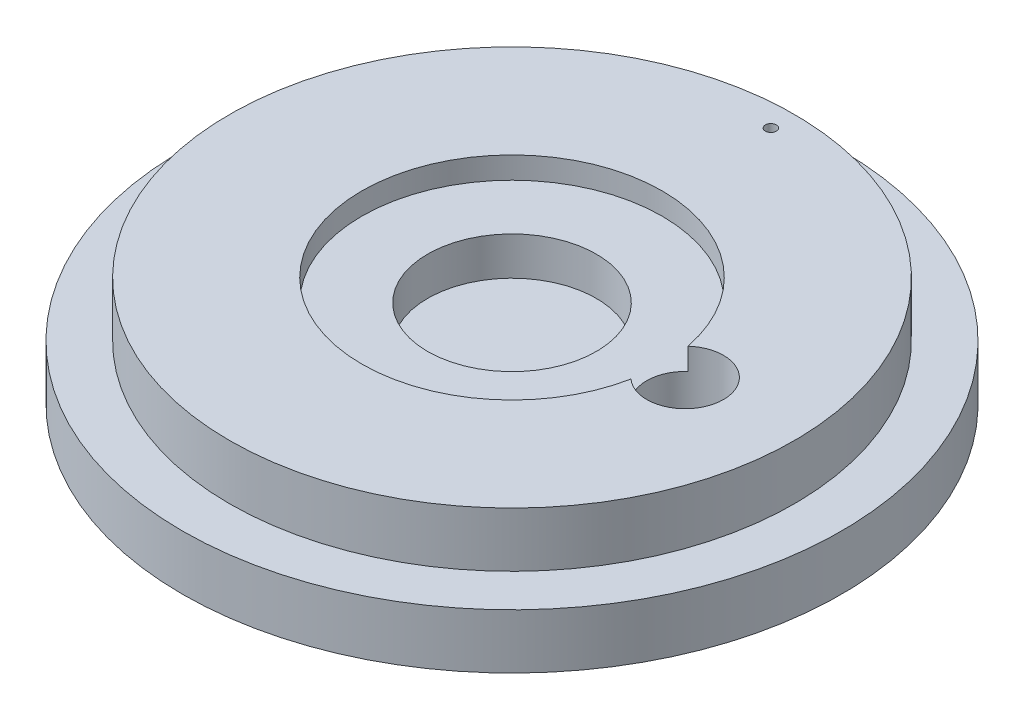
ISO-10303-21;
HEADER;
FILE_DESCRIPTION(('STEP AP214'),'2;1');
FILE_NAME('part.step','',(''),(''),'','','');
FILE_SCHEMA(('AUTOMOTIVE_DESIGN { 1 0 10303 214 1 1 1 1 }'));
ENDSEC;
DATA;
#1=APPLICATION_CONTEXT('core data for automotive mechanical design processes');
#2=APPLICATION_PROTOCOL_DEFINITION('international standard','automotive_design',2000,#1);
#3=PRODUCT_CONTEXT('',#1,'mechanical');
#4=PRODUCT('Part','Part','',(#3));
#5=PRODUCT_RELATED_PRODUCT_CATEGORY('part','',(#4));
#6=PRODUCT_DEFINITION_FORMATION('','',#4);
#7=PRODUCT_DEFINITION_CONTEXT('part definition',#1,'design');
#8=PRODUCT_DEFINITION('design','',#6,#7);
#9=PRODUCT_DEFINITION_SHAPE('','',#8);
#10=(LENGTH_UNIT() NAMED_UNIT(*) SI_UNIT(.MILLI.,.METRE.));
#11=(NAMED_UNIT(*) PLANE_ANGLE_UNIT() SI_UNIT($,.RADIAN.));
#12=(NAMED_UNIT(*) SI_UNIT($,.STERADIAN.) SOLID_ANGLE_UNIT());
#13=UNCERTAINTY_MEASURE_WITH_UNIT(LENGTH_MEASURE(1.E-05),#10,'distance_accuracy_value','');
#14=(GEOMETRIC_REPRESENTATION_CONTEXT(3) GLOBAL_UNCERTAINTY_ASSIGNED_CONTEXT((#13)) GLOBAL_UNIT_ASSIGNED_CONTEXT((#10,
#11,#12)) REPRESENTATION_CONTEXT('',''));
#15=CARTESIAN_POINT('',(0.,0.,0.));
#16=DIRECTION('',(0.,0.,1.));
#17=DIRECTION('',(1.,0.,0.));
#18=AXIS2_PLACEMENT_3D('',#15,#16,#17);
#19=CARTESIAN_POINT('',(0.,0.,0.));
#20=DIRECTION('',(0.,-1.,0.));
#21=DIRECTION('',(0.,0.,-1.));
#22=AXIS2_PLACEMENT_3D('',#19,#20,#21);
#23=PLANE('',#22);
#24=CARTESIAN_POINT('',(0.,0.,0.));
#25=DIRECTION('',(0.,1.,0.));
#26=DIRECTION('',(0.,0.,1.));
#27=AXIS2_PLACEMENT_3D('',#24,#25,#26);
#28=CIRCLE('',#27,30.075);
#29=CARTESIAN_POINT('',(0.,0.,30.075));
#30=VERTEX_POINT('',#29);
#31=EDGE_CURVE('E40',#30,#30,#28,.T.);
#32=ORIENTED_EDGE('',*,*,#31,.F.);
#33=EDGE_LOOP('',(#32));
#34=FACE_BOUND('',#33,.T.);
#35=CARTESIAN_POINT('',(15.8,0.,0.));
#36=DIRECTION('',(0.,1.,0.));
#37=DIRECTION('',(0.,0.,1.));
#38=AXIS2_PLACEMENT_3D('',#35,#36,#37);
#39=CIRCLE('',#38,3.5);
#40=CARTESIAN_POINT('',(15.8,0.,3.5));
#41=VERTEX_POINT('',#40);
#42=EDGE_CURVE('E62',#41,#41,#39,.T.);
#43=ORIENTED_EDGE('',*,*,#42,.T.);
#44=EDGE_LOOP('',(#43));
#45=FACE_BOUND('',#44,.T.);
#46=CARTESIAN_POINT('',(0.,0.,-23.625));
#47=DIRECTION('',(0.,1.,0.));
#48=DIRECTION('',(0.,0.,1.));
#49=AXIS2_PLACEMENT_3D('',#46,#47,#48);
#50=CIRCLE('',#49,0.5);
#51=CARTESIAN_POINT('',(0.,0.,-23.125));
#52=VERTEX_POINT('',#51);
#53=EDGE_CURVE('E101',#52,#52,#50,.T.);
#54=ORIENTED_EDGE('',*,*,#53,.T.);
#55=EDGE_LOOP('',(#54));
#56=FACE_BOUND('',#55,.T.);
#57=ADVANCED_FACE('F33',(#34,#45,#56),#23,.T.);
#58=CARTESIAN_POINT('',(-25.775,9.99999999999999,0.));
#59=DIRECTION('',(0.,1.,0.));
#60=DIRECTION('',(0.,0.,1.));
#61=AXIS2_PLACEMENT_3D('',#58,#59,#60);
#62=PLANE('',#61);
#63=CARTESIAN_POINT('',(0.,9.99999999999999,0.));
#64=DIRECTION('',(0.,1.,0.));
#65=DIRECTION('',(0.,0.,1.));
#66=AXIS2_PLACEMENT_3D('',#63,#64,#65);
#67=CIRCLE('',#66,25.775);
#68=CARTESIAN_POINT('',(0.,9.99999999999999,25.775));
#69=VERTEX_POINT('',#68);
#70=EDGE_CURVE('E75',#69,#69,#67,.T.);
#71=ORIENTED_EDGE('',*,*,#70,.T.);
#72=EDGE_LOOP('',(#71));
#73=FACE_BOUND('',#72,.T.);
#74=CARTESIAN_POINT('',(15.8,9.99999999999999,0.));
#75=DIRECTION('',(0.,1.,0.));
#76=DIRECTION('',(0.,0.,1.));
#77=AXIS2_PLACEMENT_3D('',#74,#75,#76);
#78=CIRCLE('',#77,3.5);
#79=CARTESIAN_POINT('',(13.4518987341772,9.99999999999999,2.59546150914273));
#80=VERTEX_POINT('',#79);
#81=CARTESIAN_POINT('',(13.4518987341772,9.99999999999999,-2.59546150914273));
#82=VERTEX_POINT('',#81);
#83=EDGE_CURVE('E55',#80,#82,#78,.T.);
#84=ORIENTED_EDGE('',*,*,#83,.F.);
#85=CARTESIAN_POINT('',(0.,9.99999999999999,0.));
#86=DIRECTION('',(0.,1.,0.));
#87=DIRECTION('',(0.,0.,1.));
#88=AXIS2_PLACEMENT_3D('',#85,#86,#87);
#89=CIRCLE('',#88,13.7);
#90=EDGE_CURVE('E68',#82,#80,#89,.T.);
#91=ORIENTED_EDGE('',*,*,#90,.F.);
#92=EDGE_LOOP('',(#84,#91));
#93=FACE_BOUND('',#92,.T.);
#94=CARTESIAN_POINT('',(0.,9.99999999999999,-23.625));
#95=DIRECTION('',(0.,1.,0.));
#96=DIRECTION('',(0.,0.,1.));
#97=AXIS2_PLACEMENT_3D('',#94,#95,#96);
#98=CIRCLE('',#97,0.5);
#99=CARTESIAN_POINT('',(0.,9.99999999999999,-23.125));
#100=VERTEX_POINT('',#99);
#101=EDGE_CURVE('E63',#100,#100,#98,.T.);
#102=ORIENTED_EDGE('',*,*,#101,.F.);
#103=EDGE_LOOP('',(#102));
#104=FACE_BOUND('',#103,.T.);
#105=ADVANCED_FACE('F73',(#73,#93,#104),#62,.T.);
#106=CARTESIAN_POINT('',(0.,4.49999999999999,0.));
#107=DIRECTION('',(0.,1.,0.));
#108=DIRECTION('',(0.,0.,1.));
#109=AXIS2_PLACEMENT_3D('',#106,#107,#108);
#110=CYLINDRICAL_SURFACE('',#109,30.075);
#111=ORIENTED_EDGE('',*,*,#31,.T.);
#112=EDGE_LOOP('',(#111));
#113=FACE_BOUND('',#112,.T.);
#114=CARTESIAN_POINT('',(0.,5.,0.));
#115=DIRECTION('',(0.,1.,0.));
#116=DIRECTION('',(0.,0.,1.));
#117=AXIS2_PLACEMENT_3D('',#114,#115,#116);
#118=CIRCLE('',#117,30.075);
#119=CARTESIAN_POINT('',(0.,5.,30.075));
#120=VERTEX_POINT('',#119);
#121=EDGE_CURVE('E86',#120,#120,#118,.T.);
#122=ORIENTED_EDGE('',*,*,#121,.F.);
#123=EDGE_LOOP('',(#122));
#124=FACE_BOUND('',#123,.T.);
#125=ADVANCED_FACE('F91',(#113,#124),#110,.T.);
#126=CARTESIAN_POINT('',(-30.075,5.,0.));
#127=DIRECTION('',(0.,1.,0.));
#128=DIRECTION('',(0.,0.,1.));
#129=AXIS2_PLACEMENT_3D('',#126,#127,#128);
#130=PLANE('',#129);
#131=ORIENTED_EDGE('',*,*,#121,.T.);
#132=EDGE_LOOP('',(#131));
#133=FACE_BOUND('',#132,.T.);
#134=CARTESIAN_POINT('',(0.,5.,0.));
#135=DIRECTION('',(0.,1.,0.));
#136=DIRECTION('',(0.,0.,1.));
#137=AXIS2_PLACEMENT_3D('',#134,#135,#136);
#138=CIRCLE('',#137,25.775);
#139=CARTESIAN_POINT('',(0.,5.,25.775));
#140=VERTEX_POINT('',#139);
#141=EDGE_CURVE('E78',#140,#140,#138,.T.);
#142=ORIENTED_EDGE('',*,*,#141,.F.);
#143=EDGE_LOOP('',(#142));
#144=FACE_BOUND('',#143,.T.);
#145=ADVANCED_FACE('F135',(#133,#144),#130,.T.);
#146=CARTESIAN_POINT('',(0.,4.49999999999999,0.));
#147=DIRECTION('',(0.,1.,0.));
#148=DIRECTION('',(0.,0.,1.));
#149=AXIS2_PLACEMENT_3D('',#146,#147,#148);
#150=CYLINDRICAL_SURFACE('',#149,25.775);
#151=ORIENTED_EDGE('',*,*,#141,.T.);
#152=EDGE_LOOP('',(#151));
#153=FACE_BOUND('',#152,.T.);
#154=ORIENTED_EDGE('',*,*,#70,.F.);
#155=EDGE_LOOP('',(#154));
#156=FACE_BOUND('',#155,.T.);
#157=ADVANCED_FACE('F126',(#153,#156),#150,.T.);
#158=CARTESIAN_POINT('',(0.,4.49999999999999,0.));
#159=DIRECTION('',(0.,1.,0.));
#160=DIRECTION('',(0.,0.,1.));
#161=AXIS2_PLACEMENT_3D('',#158,#159,#160);
#162=CYLINDRICAL_SURFACE('',#161,13.7);
#163=DIRECTION('',(0.,1.,0.));
#164=VECTOR('',#163,1.);
#165=CARTESIAN_POINT('',(13.4518987341772,4.99999999999999,-2.59546150914273));
#166=LINE('',#165,#164);
#167=CARTESIAN_POINT('',(13.4518987341772,7.99999999999999,-2.59546150914272));
#168=VERTEX_POINT('',#167);
#169=EDGE_CURVE('E46',#82,#168,#166,.F.);
#170=ORIENTED_EDGE('',*,*,#169,.F.);
#171=ORIENTED_EDGE('',*,*,#90,.T.);
#172=DIRECTION('',(0.,1.,0.));
#173=VECTOR('',#172,1.);
#174=CARTESIAN_POINT('',(13.4518987341772,4.99999999999999,2.59546150914273));
#175=LINE('',#174,#173);
#176=CARTESIAN_POINT('',(13.4518987341772,7.99999999999999,2.59546150914272));
#177=VERTEX_POINT('',#176);
#178=EDGE_CURVE('E58',#177,#80,#175,.T.);
#179=ORIENTED_EDGE('',*,*,#178,.F.);
#180=CARTESIAN_POINT('',(0.,7.99999999999999,0.));
#181=DIRECTION('',(0.,1.,0.));
#182=DIRECTION('',(0.,0.,1.));
#183=AXIS2_PLACEMENT_3D('',#180,#181,#182);
#184=CIRCLE('',#183,13.7);
#185=EDGE_CURVE('E70',#168,#177,#184,.T.);
#186=ORIENTED_EDGE('',*,*,#185,.F.);
#187=EDGE_LOOP('',(#170,#171,#179,#186));
#188=FACE_BOUND('',#187,.T.);
#189=ADVANCED_FACE('F67',(#188),#162,.F.);
#190=CARTESIAN_POINT('',(-13.7,7.99999999999999,0.));
#191=DIRECTION('',(0.,1.,0.));
#192=DIRECTION('',(0.,0.,1.));
#193=AXIS2_PLACEMENT_3D('',#190,#191,#192);
#194=PLANE('',#193);
#195=CARTESIAN_POINT('',(15.8,7.99999999999999,0.));
#196=DIRECTION('',(0.,1.,0.));
#197=DIRECTION('',(0.,0.,1.));
#198=AXIS2_PLACEMENT_3D('',#195,#196,#197);
#199=CIRCLE('',#198,3.5);
#200=EDGE_CURVE('E11',#168,#177,#199,.T.);
#201=ORIENTED_EDGE('',*,*,#200,.F.);
#202=ORIENTED_EDGE('',*,*,#185,.T.);
#203=EDGE_LOOP('',(#201,#202));
#204=FACE_BOUND('',#203,.T.);
#205=CARTESIAN_POINT('',(0.,7.99999999999999,0.));
#206=DIRECTION('',(0.,1.,0.));
#207=DIRECTION('',(0.,0.,1.));
#208=AXIS2_PLACEMENT_3D('',#205,#206,#207);
#209=CIRCLE('',#208,7.7);
#210=CARTESIAN_POINT('',(0.,7.99999999999999,7.7));
#211=VERTEX_POINT('',#210);
#212=EDGE_CURVE('E80',#211,#211,#209,.T.);
#213=ORIENTED_EDGE('',*,*,#212,.F.);
#214=EDGE_LOOP('',(#213));
#215=FACE_BOUND('',#214,.T.);
#216=ADVANCED_FACE('F116',(#204,#215),#194,.T.);
#217=CARTESIAN_POINT('',(0.,4.49999999999999,0.));
#218=DIRECTION('',(0.,1.,0.));
#219=DIRECTION('',(0.,0.,1.));
#220=AXIS2_PLACEMENT_3D('',#217,#218,#219);
#221=CYLINDRICAL_SURFACE('',#220,7.7);
#222=ORIENTED_EDGE('',*,*,#212,.T.);
#223=EDGE_LOOP('',(#222));
#224=FACE_BOUND('',#223,.T.);
#225=CARTESIAN_POINT('',(0.,4.49999999999999,0.));
#226=DIRECTION('',(0.,1.,0.));
#227=DIRECTION('',(0.,0.,1.));
#228=AXIS2_PLACEMENT_3D('',#225,#226,#227);
#229=CIRCLE('',#228,7.7);
#230=CARTESIAN_POINT('',(0.,4.49999999999999,7.7));
#231=VERTEX_POINT('',#230);
#232=EDGE_CURVE('E71',#231,#231,#229,.T.);
#233=ORIENTED_EDGE('',*,*,#232,.F.);
#234=EDGE_LOOP('',(#233));
#235=FACE_BOUND('',#234,.T.);
#236=ADVANCED_FACE('F113',(#224,#235),#221,.F.);
#237=CARTESIAN_POINT('',(-7.7,4.49999999999999,0.));
#238=DIRECTION('',(0.,1.,0.));
#239=DIRECTION('',(0.,0.,1.));
#240=AXIS2_PLACEMENT_3D('',#237,#238,#239);
#241=PLANE('',#240);
#242=ORIENTED_EDGE('',*,*,#232,.T.);
#243=EDGE_LOOP('',(#242));
#244=FACE_BOUND('',#243,.T.);
#245=ADVANCED_FACE('F124',(#244),#241,.T.);
#246=CARTESIAN_POINT('',(15.8,0.,0.));
#247=DIRECTION('',(0.,1.,0.));
#248=DIRECTION('',(0.,0.,1.));
#249=AXIS2_PLACEMENT_3D('',#246,#247,#248);
#250=CYLINDRICAL_SURFACE('',#249,3.5);
#251=ORIENTED_EDGE('',*,*,#169,.T.);
#252=ORIENTED_EDGE('',*,*,#200,.T.);
#253=ORIENTED_EDGE('',*,*,#178,.T.);
#254=ORIENTED_EDGE('',*,*,#83,.T.);
#255=EDGE_LOOP('',(#251,#252,#253,#254));
#256=FACE_BOUND('',#255,.T.);
#257=ORIENTED_EDGE('',*,*,#42,.F.);
#258=EDGE_LOOP('',(#257));
#259=FACE_BOUND('',#258,.T.);
#260=ADVANCED_FACE('F56',(#256,#259),#250,.F.);
#261=CARTESIAN_POINT('',(0.,9.99999999999999,-23.625));
#262=DIRECTION('',(0.,-1.,0.));
#263=DIRECTION('',(0.,0.,-1.));
#264=AXIS2_PLACEMENT_3D('',#261,#262,#263);
#265=CYLINDRICAL_SURFACE('',#264,0.5);
#266=ORIENTED_EDGE('',*,*,#101,.T.);
#267=EDGE_LOOP('',(#266));
#268=FACE_BOUND('',#267,.T.);
#269=ORIENTED_EDGE('',*,*,#53,.F.);
#270=EDGE_LOOP('',(#269));
#271=FACE_BOUND('',#270,.T.);
#272=ADVANCED_FACE('F175',(#268,#271),#265,.F.);
#273=CLOSED_SHELL('',(#57,#105,#125,#145,#157,#189,#216,#236,#245,#260,#272));
#274=MANIFOLD_SOLID_BREP('B2',#273);
#275=ADVANCED_BREP_SHAPE_REPRESENTATION('',(#18,#274),#14);
#276=SHAPE_DEFINITION_REPRESENTATION(#9,#275);
ENDSEC;
END-ISO-10303-21;
